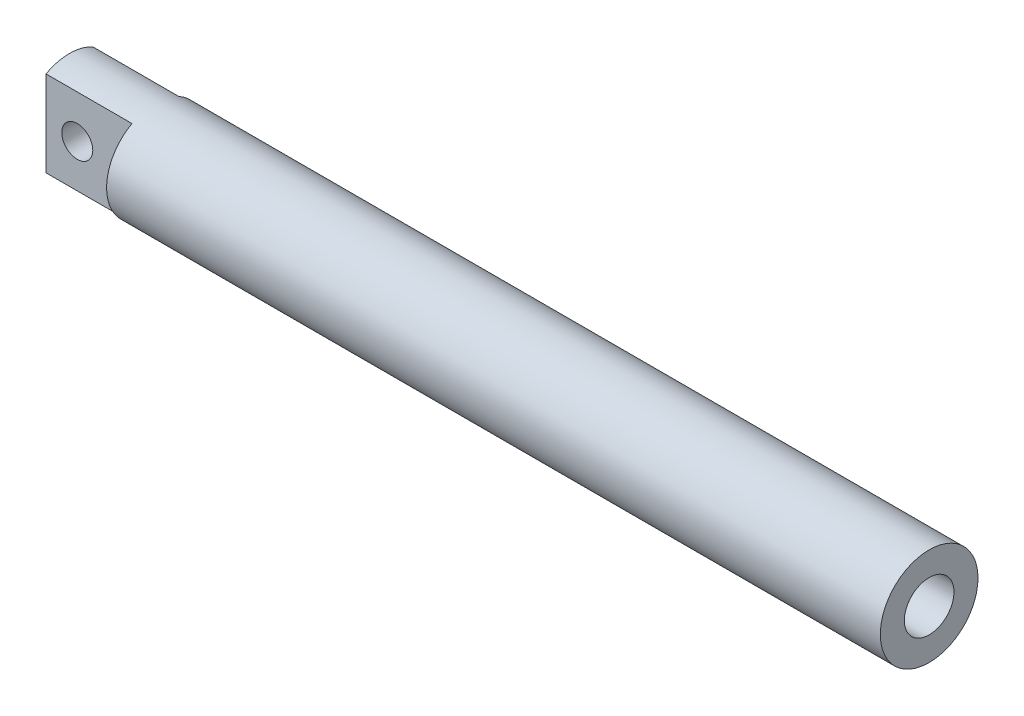
ISO-10303-21;
HEADER;
FILE_DESCRIPTION(('STEP AP214'),'2;1');
FILE_NAME('part.step','',(''),(''),'','','');
FILE_SCHEMA(('AUTOMOTIVE_DESIGN { 1 0 10303 214 1 1 1 1 }'));
ENDSEC;
DATA;
#1=APPLICATION_CONTEXT('core data for automotive mechanical design processes');
#2=APPLICATION_PROTOCOL_DEFINITION('international standard','automotive_design',2000,#1);
#3=PRODUCT_CONTEXT('',#1,'mechanical');
#4=PRODUCT('Part','Part','',(#3));
#5=PRODUCT_RELATED_PRODUCT_CATEGORY('part','',(#4));
#6=PRODUCT_DEFINITION_FORMATION('','',#4);
#7=PRODUCT_DEFINITION_CONTEXT('part definition',#1,'design');
#8=PRODUCT_DEFINITION('design','',#6,#7);
#9=PRODUCT_DEFINITION_SHAPE('','',#8);
#10=(LENGTH_UNIT() NAMED_UNIT(*) SI_UNIT(.MILLI.,.METRE.));
#11=(NAMED_UNIT(*) PLANE_ANGLE_UNIT() SI_UNIT($,.RADIAN.));
#12=(NAMED_UNIT(*) SI_UNIT($,.STERADIAN.) SOLID_ANGLE_UNIT());
#13=UNCERTAINTY_MEASURE_WITH_UNIT(LENGTH_MEASURE(1.E-05),#10,'distance_accuracy_value','');
#14=(GEOMETRIC_REPRESENTATION_CONTEXT(3) GLOBAL_UNCERTAINTY_ASSIGNED_CONTEXT((#13)) GLOBAL_UNIT_ASSIGNED_CONTEXT((#10,
#11,#12)) REPRESENTATION_CONTEXT('',''));
#15=CARTESIAN_POINT('',(0.,0.,0.));
#16=DIRECTION('',(0.,0.,1.));
#17=DIRECTION('',(1.,0.,0.));
#18=AXIS2_PLACEMENT_3D('',#15,#16,#17);
#19=CARTESIAN_POINT('',(220.,0.,0.));
#20=DIRECTION('',(-1.,0.,0.));
#21=DIRECTION('',(0.,0.,1.));
#22=AXIS2_PLACEMENT_3D('',#19,#20,#21);
#23=CYLINDRICAL_SURFACE('',#22,12.5);
#24=CARTESIAN_POINT('',(220.,0.,0.));
#25=DIRECTION('',(1.,0.,0.));
#26=DIRECTION('',(0.,0.,-1.));
#27=AXIS2_PLACEMENT_3D('',#24,#25,#26);
#28=CIRCLE('',#27,12.5);
#29=CARTESIAN_POINT('',(220.,0.,-12.5));
#30=VERTEX_POINT('',#29);
#31=EDGE_CURVE('E90',#30,#30,#28,.T.);
#32=ORIENTED_EDGE('',*,*,#31,.F.);
#33=EDGE_LOOP('',(#32));
#34=FACE_BOUND('',#33,.T.);
#35=CARTESIAN_POINT('',(22.,0.,0.));
#36=DIRECTION('',(-1.,0.,0.));
#37=DIRECTION('',(0.,0.,1.));
#38=AXIS2_PLACEMENT_3D('',#35,#36,#37);
#39=CIRCLE('',#38,12.5);
#40=CARTESIAN_POINT('',(22.,-10.9658560997307,6.));
#41=VERTEX_POINT('',#40);
#42=CARTESIAN_POINT('',(22.,10.9658560997307,6.));
#43=VERTEX_POINT('',#42);
#44=EDGE_CURVE('E11',#41,#43,#39,.T.);
#45=ORIENTED_EDGE('',*,*,#44,.F.);
#46=DIRECTION('',(-1.,0.,0.));
#47=VECTOR('',#46,1.);
#48=CARTESIAN_POINT('',(220.,-10.9658560997307,6.));
#49=LINE('',#48,#47);
#50=CARTESIAN_POINT('',(0.,-10.9658560997307,6.));
#51=VERTEX_POINT('',#50);
#52=EDGE_CURVE('E75',#41,#51,#49,.T.);
#53=ORIENTED_EDGE('',*,*,#52,.T.);
#54=CARTESIAN_POINT('',(0.,0.,0.));
#55=DIRECTION('',(1.,0.,0.));
#56=DIRECTION('',(0.,0.,-1.));
#57=AXIS2_PLACEMENT_3D('',#54,#55,#56);
#58=CIRCLE('',#57,12.5);
#59=CARTESIAN_POINT('',(0.,-10.9658560997307,-6.));
#60=VERTEX_POINT('',#59);
#61=EDGE_CURVE('E57',#51,#60,#58,.T.);
#62=ORIENTED_EDGE('',*,*,#61,.T.);
#63=DIRECTION('',(-1.,0.,0.));
#64=VECTOR('',#63,1.);
#65=CARTESIAN_POINT('',(220.,-10.9658560997307,-6.));
#66=LINE('',#65,#64);
#67=CARTESIAN_POINT('',(22.,-10.9658560997307,-6.));
#68=VERTEX_POINT('',#67);
#69=EDGE_CURVE('E92',#60,#68,#66,.F.);
#70=ORIENTED_EDGE('',*,*,#69,.T.);
#71=CARTESIAN_POINT('',(22.,0.,0.));
#72=DIRECTION('',(-1.,0.,0.));
#73=DIRECTION('',(0.,0.,1.));
#74=AXIS2_PLACEMENT_3D('',#71,#72,#73);
#75=CIRCLE('',#74,12.5);
#76=CARTESIAN_POINT('',(22.,10.9658560997307,-6.));
#77=VERTEX_POINT('',#76);
#78=EDGE_CURVE('E80',#77,#68,#75,.T.);
#79=ORIENTED_EDGE('',*,*,#78,.F.);
#80=DIRECTION('',(-1.,0.,0.));
#81=VECTOR('',#80,1.);
#82=CARTESIAN_POINT('',(220.,10.9658560997307,-6.));
#83=LINE('',#82,#81);
#84=CARTESIAN_POINT('',(0.,10.9658560997307,-6.));
#85=VERTEX_POINT('',#84);
#86=EDGE_CURVE('E88',#77,#85,#83,.T.);
#87=ORIENTED_EDGE('',*,*,#86,.T.);
#88=CARTESIAN_POINT('',(0.,10.9658560997307,6.));
#89=VERTEX_POINT('',#88);
#90=EDGE_CURVE('E87',#85,#89,#58,.T.);
#91=ORIENTED_EDGE('',*,*,#90,.T.);
#92=DIRECTION('',(-1.,0.,0.));
#93=VECTOR('',#92,1.);
#94=CARTESIAN_POINT('',(220.,10.9658560997307,6.));
#95=LINE('',#94,#93);
#96=EDGE_CURVE('E49',#89,#43,#95,.F.);
#97=ORIENTED_EDGE('',*,*,#96,.T.);
#98=EDGE_LOOP('',(#45,#53,#62,#70,#79,#87,#91,#97));
#99=FACE_BOUND('',#98,.T.);
#100=ADVANCED_FACE('F35',(#34,#99),#23,.T.);
#101=CARTESIAN_POINT('',(220.,0.,0.));
#102=DIRECTION('',(1.,0.,0.));
#103=DIRECTION('',(0.,0.,-1.));
#104=AXIS2_PLACEMENT_3D('',#101,#102,#103);
#105=PLANE('',#104);
#106=CARTESIAN_POINT('',(220.,0.,0.));
#107=DIRECTION('',(1.,0.,0.));
#108=DIRECTION('',(0.,0.,-1.));
#109=AXIS2_PLACEMENT_3D('',#106,#107,#108);
#110=CIRCLE('',#109,6.35);
#111=CARTESIAN_POINT('',(220.,0.,-6.35));
#112=VERTEX_POINT('',#111);
#113=EDGE_CURVE('E117',#112,#112,#110,.T.);
#114=ORIENTED_EDGE('',*,*,#113,.F.);
#115=EDGE_LOOP('',(#114));
#116=FACE_BOUND('',#115,.T.);
#117=ORIENTED_EDGE('',*,*,#31,.T.);
#118=EDGE_LOOP('',(#117));
#119=FACE_BOUND('',#118,.T.);
#120=ADVANCED_FACE('F132',(#116,#119),#105,.T.);
#121=CARTESIAN_POINT('',(0.,0.,0.));
#122=DIRECTION('',(1.,0.,0.));
#123=DIRECTION('',(0.,0.,-1.));
#124=AXIS2_PLACEMENT_3D('',#121,#122,#123);
#125=PLANE('',#124);
#126=ORIENTED_EDGE('',*,*,#61,.F.);
#127=DIRECTION('',(0.,1.,0.));
#128=VECTOR('',#127,1.);
#129=CARTESIAN_POINT('',(0.,0.,6.));
#130=LINE('',#129,#128);
#131=EDGE_CURVE('E42',#51,#89,#130,.T.);
#132=ORIENTED_EDGE('',*,*,#131,.T.);
#133=ORIENTED_EDGE('',*,*,#90,.F.);
#134=DIRECTION('',(0.,-1.,0.));
#135=VECTOR('',#134,1.);
#136=CARTESIAN_POINT('',(0.,0.,-6.));
#137=LINE('',#136,#135);
#138=EDGE_CURVE('E86',#85,#60,#137,.T.);
#139=ORIENTED_EDGE('',*,*,#138,.T.);
#140=EDGE_LOOP('',(#126,#132,#133,#139));
#141=FACE_BOUND('',#140,.T.);
#142=ADVANCED_FACE('F85',(#141),#125,.F.);
#143=CARTESIAN_POINT('',(22.,0.,0.));
#144=DIRECTION('',(-1.,0.,0.));
#145=DIRECTION('',(0.,0.,1.));
#146=AXIS2_PLACEMENT_3D('',#143,#144,#145);
#147=PLANE('',#146);
#148=ORIENTED_EDGE('',*,*,#78,.T.);
#149=DIRECTION('',(0.,1.,0.));
#150=VECTOR('',#149,1.);
#151=CARTESIAN_POINT('',(22.,14.6409998002912,-6.));
#152=LINE('',#151,#150);
#153=EDGE_CURVE('E82',#68,#77,#152,.T.);
#154=ORIENTED_EDGE('',*,*,#153,.T.);
#155=EDGE_LOOP('',(#148,#154));
#156=FACE_BOUND('',#155,.T.);
#157=ADVANCED_FACE('F101',(#156),#147,.T.);
#158=CARTESIAN_POINT('',(22.,14.6409998002912,-6.));
#159=DIRECTION('',(0.,0.,1.));
#160=DIRECTION('',(0.,-1.,0.));
#161=AXIS2_PLACEMENT_3D('',#158,#159,#160);
#162=PLANE('',#161);
#163=CARTESIAN_POINT('',(8.,0.,-6.));
#164=DIRECTION('',(0.,0.,1.));
#165=DIRECTION('',(0.,-1.,0.));
#166=AXIS2_PLACEMENT_3D('',#163,#164,#165);
#167=CIRCLE('',#166,3.96875);
#168=CARTESIAN_POINT('',(8.,-3.96875,-6.));
#169=VERTEX_POINT('',#168);
#170=EDGE_CURVE('E110',#169,#169,#167,.T.);
#171=ORIENTED_EDGE('',*,*,#170,.T.);
#172=EDGE_LOOP('',(#171));
#173=FACE_BOUND('',#172,.T.);
#174=ORIENTED_EDGE('',*,*,#153,.F.);
#175=ORIENTED_EDGE('',*,*,#69,.F.);
#176=ORIENTED_EDGE('',*,*,#138,.F.);
#177=ORIENTED_EDGE('',*,*,#86,.F.);
#178=EDGE_LOOP('',(#174,#175,#176,#177));
#179=FACE_BOUND('',#178,.T.);
#180=ADVANCED_FACE('F103',(#173,#179),#162,.F.);
#181=CARTESIAN_POINT('',(22.,0.,0.));
#182=DIRECTION('',(-1.,0.,0.));
#183=DIRECTION('',(0.,0.,1.));
#184=AXIS2_PLACEMENT_3D('',#181,#182,#183);
#185=PLANE('',#184);
#186=ORIENTED_EDGE('',*,*,#44,.T.);
#187=DIRECTION('',(0.,-1.,0.));
#188=VECTOR('',#187,1.);
#189=CARTESIAN_POINT('',(22.,-13.8625779920904,6.));
#190=LINE('',#189,#188);
#191=EDGE_CURVE('E108',#43,#41,#190,.T.);
#192=ORIENTED_EDGE('',*,*,#191,.T.);
#193=EDGE_LOOP('',(#186,#192));
#194=FACE_BOUND('',#193,.T.);
#195=ADVANCED_FACE('F166',(#194),#185,.T.);
#196=CARTESIAN_POINT('',(22.,-13.8625779920904,6.));
#197=DIRECTION('',(0.,0.,-1.));
#198=DIRECTION('',(-1.,0.,0.));
#199=AXIS2_PLACEMENT_3D('',#196,#197,#198);
#200=PLANE('',#199);
#201=CARTESIAN_POINT('',(8.,0.,6.));
#202=DIRECTION('',(0.,0.,1.));
#203=DIRECTION('',(1.,0.,0.));
#204=AXIS2_PLACEMENT_3D('',#201,#202,#203);
#205=CIRCLE('',#204,3.96875);
#206=CARTESIAN_POINT('',(11.96875,0.,6.));
#207=VERTEX_POINT('',#206);
#208=EDGE_CURVE('E113',#207,#207,#205,.T.);
#209=ORIENTED_EDGE('',*,*,#208,.F.);
#210=EDGE_LOOP('',(#209));
#211=FACE_BOUND('',#210,.T.);
#212=ORIENTED_EDGE('',*,*,#191,.F.);
#213=ORIENTED_EDGE('',*,*,#96,.F.);
#214=ORIENTED_EDGE('',*,*,#131,.F.);
#215=ORIENTED_EDGE('',*,*,#52,.F.);
#216=EDGE_LOOP('',(#212,#213,#214,#215));
#217=FACE_BOUND('',#216,.T.);
#218=ADVANCED_FACE('F74',(#211,#217),#200,.F.);
#219=CARTESIAN_POINT('',(8.,0.,-16.));
#220=DIRECTION('',(0.,0.,1.));
#221=DIRECTION('',(1.,0.,0.));
#222=AXIS2_PLACEMENT_3D('',#219,#220,#221);
#223=CYLINDRICAL_SURFACE('',#222,3.96875);
#224=ORIENTED_EDGE('',*,*,#208,.T.);
#225=EDGE_LOOP('',(#224));
#226=FACE_BOUND('',#225,.T.);
#227=ORIENTED_EDGE('',*,*,#170,.F.);
#228=EDGE_LOOP('',(#227));
#229=FACE_BOUND('',#228,.T.);
#230=ADVANCED_FACE('F128',(#226,#229),#223,.F.);
#231=CARTESIAN_POINT('',(80.,0.,0.));
#232=DIRECTION('',(1.,0.,0.));
#233=DIRECTION('',(0.,0.,-1.));
#234=AXIS2_PLACEMENT_3D('',#231,#232,#233);
#235=CYLINDRICAL_SURFACE('',#234,6.35);
#236=CARTESIAN_POINT('',(80.,0.,0.));
#237=DIRECTION('',(1.,0.,0.));
#238=DIRECTION('',(0.,0.,-1.));
#239=AXIS2_PLACEMENT_3D('',#236,#237,#238);
#240=CIRCLE('',#239,6.35);
#241=CARTESIAN_POINT('',(80.,0.,-6.35));
#242=VERTEX_POINT('',#241);
#243=EDGE_CURVE('E116',#242,#242,#240,.T.);
#244=ORIENTED_EDGE('',*,*,#243,.F.);
#245=EDGE_LOOP('',(#244));
#246=FACE_BOUND('',#245,.T.);
#247=ORIENTED_EDGE('',*,*,#113,.T.);
#248=EDGE_LOOP('',(#247));
#249=FACE_BOUND('',#248,.T.);
#250=ADVANCED_FACE('F125',(#246,#249),#235,.F.);
#251=CARTESIAN_POINT('',(80.,0.,0.));
#252=DIRECTION('',(1.,0.,0.));
#253=DIRECTION('',(0.,0.,-1.));
#254=AXIS2_PLACEMENT_3D('',#251,#252,#253);
#255=PLANE('',#254);
#256=ORIENTED_EDGE('',*,*,#243,.T.);
#257=EDGE_LOOP('',(#256));
#258=FACE_BOUND('',#257,.T.);
#259=ADVANCED_FACE('F123',(#258),#255,.T.);
#260=CLOSED_SHELL('',(#100,#120,#142,#157,#180,#195,#218,#230,#250,#259));
#261=MANIFOLD_SOLID_BREP('B2',#260);
#262=ADVANCED_BREP_SHAPE_REPRESENTATION('',(#18,#261),#14);
#263=SHAPE_DEFINITION_REPRESENTATION(#9,#262);
ENDSEC;
END-ISO-10303-21;
